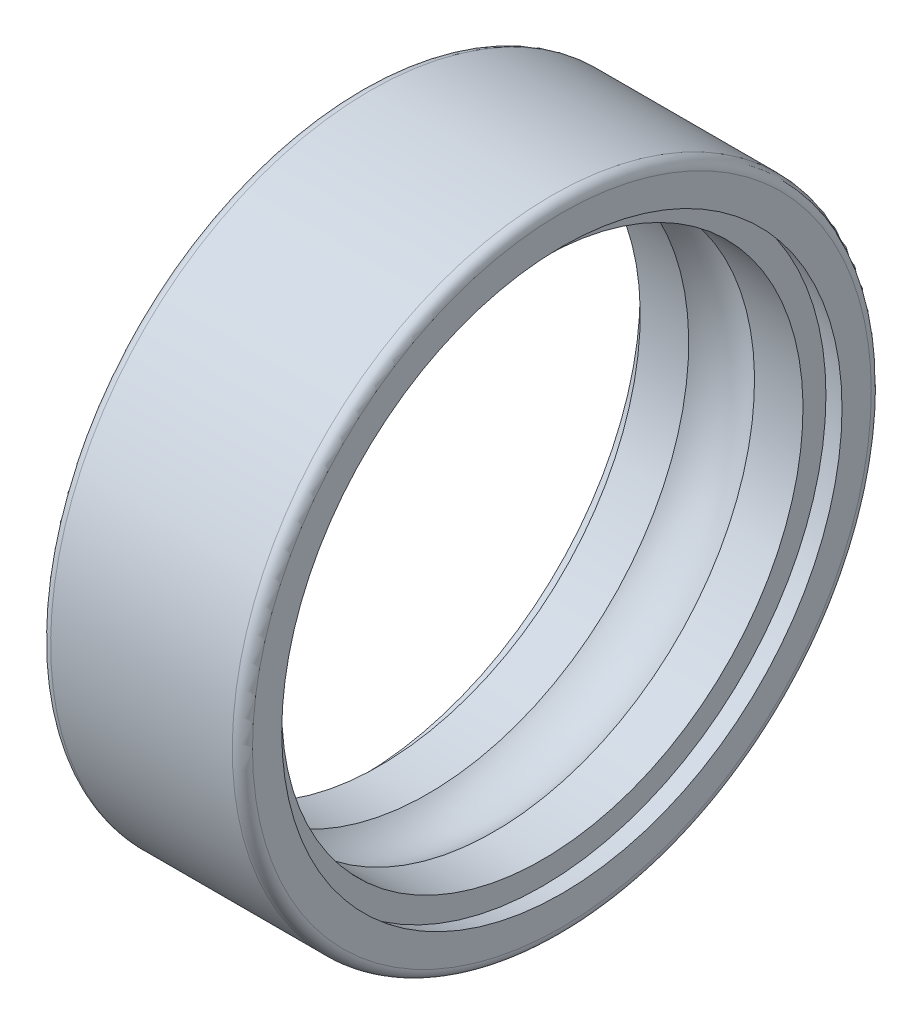
ISO-10303-21;
HEADER;
FILE_DESCRIPTION(('STEP AP214'),'2;1');
FILE_NAME('part.step','',(''),(''),'','','');
FILE_SCHEMA(('AUTOMOTIVE_DESIGN { 1 0 10303 214 1 1 1 1 }'));
ENDSEC;
DATA;
#1=APPLICATION_CONTEXT('core data for automotive mechanical design processes');
#2=APPLICATION_PROTOCOL_DEFINITION('international standard','automotive_design',2000,#1);
#3=PRODUCT_CONTEXT('',#1,'mechanical');
#4=PRODUCT('Part','Part','',(#3));
#5=PRODUCT_RELATED_PRODUCT_CATEGORY('part','',(#4));
#6=PRODUCT_DEFINITION_FORMATION('','',#4);
#7=PRODUCT_DEFINITION_CONTEXT('part definition',#1,'design');
#8=PRODUCT_DEFINITION('design','',#6,#7);
#9=PRODUCT_DEFINITION_SHAPE('','',#8);
#10=(LENGTH_UNIT() NAMED_UNIT(*) SI_UNIT(.MILLI.,.METRE.));
#11=(NAMED_UNIT(*) PLANE_ANGLE_UNIT() SI_UNIT($,.RADIAN.));
#12=(NAMED_UNIT(*) SI_UNIT($,.STERADIAN.) SOLID_ANGLE_UNIT());
#13=UNCERTAINTY_MEASURE_WITH_UNIT(LENGTH_MEASURE(1.E-05),#10,'distance_accuracy_value','');
#14=(GEOMETRIC_REPRESENTATION_CONTEXT(3) GLOBAL_UNCERTAINTY_ASSIGNED_CONTEXT((#13)) GLOBAL_UNIT_ASSIGNED_CONTEXT((#10,
#11,#12)) REPRESENTATION_CONTEXT('',''));
#15=CARTESIAN_POINT('',(0.,0.,0.));
#16=DIRECTION('',(0.,0.,1.));
#17=DIRECTION('',(1.,0.,0.));
#18=AXIS2_PLACEMENT_3D('',#15,#16,#17);
#19=CARTESIAN_POINT('',(4.69929956315124,0.,0.));
#20=DIRECTION('',(-1.,0.,0.));
#21=DIRECTION('',(0.,1.,0.));
#22=AXIS2_PLACEMENT_3D('',#19,#20,#21);
#23=CYLINDRICAL_SURFACE('',#22,7.75);
#24=CARTESIAN_POINT('',(5.42,0.,0.));
#25=DIRECTION('',(1.,0.,0.));
#26=DIRECTION('',(0.,1.,0.));
#27=AXIS2_PLACEMENT_3D('',#24,#25,#26);
#28=CIRCLE('',#27,7.75);
#29=CARTESIAN_POINT('',(5.42,7.75,0.));
#30=VERTEX_POINT('',#29);
#31=EDGE_CURVE('E11',#30,#30,#28,.T.);
#32=ORIENTED_EDGE('',*,*,#31,.T.);
#33=EDGE_LOOP('',(#32));
#34=FACE_BOUND('',#33,.T.);
#35=CARTESIAN_POINT('',(3.97859912630249,0.,0.));
#36=DIRECTION('',(1.,0.,0.));
#37=DIRECTION('',(0.,1.,0.));
#38=AXIS2_PLACEMENT_3D('',#35,#36,#37);
#39=CIRCLE('',#38,7.75);
#40=CARTESIAN_POINT('',(3.97859912630249,7.75,0.));
#41=VERTEX_POINT('',#40);
#42=EDGE_CURVE('E58',#41,#41,#39,.T.);
#43=ORIENTED_EDGE('',*,*,#42,.F.);
#44=EDGE_LOOP('',(#43));
#45=FACE_BOUND('',#44,.T.);
#46=ADVANCED_FACE('F16',(#34,#45),#23,.F.);
#47=CARTESIAN_POINT('',(5.42,8.09113482440546,0.));
#48=DIRECTION('',(1.,0.,0.));
#49=DIRECTION('',(0.,1.,0.));
#50=AXIS2_PLACEMENT_3D('',#47,#48,#49);
#51=PLANE('',#50);
#52=CARTESIAN_POINT('',(5.42,0.,0.));
#53=DIRECTION('',(1.,0.,0.));
#54=DIRECTION('',(0.,1.,0.));
#55=AXIS2_PLACEMENT_3D('',#52,#53,#54);
#56=CIRCLE('',#55,8.43226964881091);
#57=CARTESIAN_POINT('',(5.42,8.43226964881091,0.));
#58=VERTEX_POINT('',#57);
#59=EDGE_CURVE('E26',#58,#58,#56,.T.);
#60=ORIENTED_EDGE('',*,*,#59,.T.);
#61=EDGE_LOOP('',(#60));
#62=FACE_BOUND('',#61,.T.);
#63=ORIENTED_EDGE('',*,*,#31,.F.);
#64=EDGE_LOOP('',(#63));
#65=FACE_BOUND('',#64,.T.);
#66=ADVANCED_FACE('F18',(#62,#65),#51,.T.);
#67=CARTESIAN_POINT('',(5.71,0.,0.));
#68=DIRECTION('',(-1.,0.,0.));
#69=DIRECTION('',(0.,1.,0.));
#70=AXIS2_PLACEMENT_3D('',#67,#68,#69);
#71=CONICAL_SURFACE('',#70,8.38113482440546,0.174532925199433);
#72=CARTESIAN_POINT('',(6.,0.,0.));
#73=DIRECTION('',(1.,0.,0.));
#74=DIRECTION('',(0.,1.,0.));
#75=AXIS2_PLACEMENT_3D('',#72,#73,#74);
#76=CIRCLE('',#75,8.33);
#77=CARTESIAN_POINT('',(6.,8.33,0.));
#78=VERTEX_POINT('',#77);
#79=EDGE_CURVE('E68',#78,#78,#76,.T.);
#80=ORIENTED_EDGE('',*,*,#79,.T.);
#81=EDGE_LOOP('',(#80));
#82=FACE_BOUND('',#81,.T.);
#83=ORIENTED_EDGE('',*,*,#59,.F.);
#84=EDGE_LOOP('',(#83));
#85=FACE_BOUND('',#84,.T.);
#86=ADVANCED_FACE('F113',(#82,#85),#71,.F.);
#87=CARTESIAN_POINT('',(6.,8.765,0.));
#88=DIRECTION('',(1.,0.,0.));
#89=DIRECTION('',(0.,1.,0.));
#90=AXIS2_PLACEMENT_3D('',#87,#88,#89);
#91=PLANE('',#90);
#92=CARTESIAN_POINT('',(6.,0.,0.));
#93=DIRECTION('',(1.,0.,0.));
#94=DIRECTION('',(0.,1.,0.));
#95=AXIS2_PLACEMENT_3D('',#92,#93,#94);
#96=CIRCLE('',#95,9.2);
#97=CARTESIAN_POINT('',(6.,9.2,0.));
#98=VERTEX_POINT('',#97);
#99=EDGE_CURVE('E72',#98,#98,#96,.T.);
#100=ORIENTED_EDGE('',*,*,#99,.T.);
#101=EDGE_LOOP('',(#100));
#102=FACE_BOUND('',#101,.T.);
#103=ORIENTED_EDGE('',*,*,#79,.F.);
#104=EDGE_LOOP('',(#103));
#105=FACE_BOUND('',#104,.T.);
#106=ADVANCED_FACE('F124',(#102,#105),#91,.T.);
#107=CARTESIAN_POINT('',(5.7,0.,0.));
#108=DIRECTION('',(1.,0.,0.));
#109=DIRECTION('',(0.,0.,-1.));
#110=AXIS2_PLACEMENT_3D('',#107,#108,#109);
#111=TOROIDAL_SURFACE('',#110,9.2,0.3);
#112=CARTESIAN_POINT('',(5.7,0.,0.));
#113=DIRECTION('',(1.,0.,0.));
#114=DIRECTION('',(0.,1.,0.));
#115=AXIS2_PLACEMENT_3D('',#112,#113,#114);
#116=CIRCLE('',#115,9.5);
#117=CARTESIAN_POINT('',(5.7,9.5,0.));
#118=VERTEX_POINT('',#117);
#119=EDGE_CURVE('E70',#118,#118,#116,.T.);
#120=ORIENTED_EDGE('',*,*,#119,.T.);
#121=EDGE_LOOP('',(#120));
#122=FACE_BOUND('',#121,.T.);
#123=ORIENTED_EDGE('',*,*,#99,.F.);
#124=EDGE_LOOP('',(#123));
#125=FACE_BOUND('',#124,.T.);
#126=ADVANCED_FACE('F120',(#122,#125),#111,.T.);
#127=CARTESIAN_POINT('',(3.,0.,0.));
#128=DIRECTION('',(-1.,0.,0.));
#129=DIRECTION('',(0.,1.,0.));
#130=AXIS2_PLACEMENT_3D('',#127,#128,#129);
#131=CYLINDRICAL_SURFACE('',#130,9.5);
#132=CARTESIAN_POINT('',(0.3,0.,0.));
#133=DIRECTION('',(1.,0.,0.));
#134=DIRECTION('',(0.,1.,0.));
#135=AXIS2_PLACEMENT_3D('',#132,#133,#134);
#136=CIRCLE('',#135,9.5);
#137=CARTESIAN_POINT('',(0.3,9.5,0.));
#138=VERTEX_POINT('',#137);
#139=EDGE_CURVE('E73',#138,#138,#136,.T.);
#140=ORIENTED_EDGE('',*,*,#139,.T.);
#141=EDGE_LOOP('',(#140));
#142=FACE_BOUND('',#141,.T.);
#143=ORIENTED_EDGE('',*,*,#119,.F.);
#144=EDGE_LOOP('',(#143));
#145=FACE_BOUND('',#144,.T.);
#146=ADVANCED_FACE('F123',(#142,#145),#131,.T.);
#147=CARTESIAN_POINT('',(0.3,0.,0.));
#148=DIRECTION('',(1.,0.,0.));
#149=DIRECTION('',(0.,0.,-1.));
#150=AXIS2_PLACEMENT_3D('',#147,#148,#149);
#151=TOROIDAL_SURFACE('',#150,9.2,0.3);
#152=CARTESIAN_POINT('',(0.,0.,0.));
#153=DIRECTION('',(1.,0.,0.));
#154=DIRECTION('',(0.,1.,0.));
#155=AXIS2_PLACEMENT_3D('',#152,#153,#154);
#156=CIRCLE('',#155,9.2);
#157=CARTESIAN_POINT('',(0.,9.2,0.));
#158=VERTEX_POINT('',#157);
#159=EDGE_CURVE('E78',#158,#158,#156,.T.);
#160=ORIENTED_EDGE('',*,*,#159,.T.);
#161=EDGE_LOOP('',(#160));
#162=FACE_BOUND('',#161,.T.);
#163=ORIENTED_EDGE('',*,*,#139,.F.);
#164=EDGE_LOOP('',(#163));
#165=FACE_BOUND('',#164,.T.);
#166=ADVANCED_FACE('F104',(#162,#165),#151,.T.);
#167=CARTESIAN_POINT('',(0.,8.765,0.));
#168=DIRECTION('',(-1.,0.,0.));
#169=DIRECTION('',(0.,-1.,0.));
#170=AXIS2_PLACEMENT_3D('',#167,#168,#169);
#171=PLANE('',#170);
#172=CARTESIAN_POINT('',(0.,0.,0.));
#173=DIRECTION('',(1.,0.,0.));
#174=DIRECTION('',(0.,1.,0.));
#175=AXIS2_PLACEMENT_3D('',#172,#173,#174);
#176=CIRCLE('',#175,8.33);
#177=CARTESIAN_POINT('',(0.,8.33,0.));
#178=VERTEX_POINT('',#177);
#179=EDGE_CURVE('E83',#178,#178,#176,.T.);
#180=ORIENTED_EDGE('',*,*,#179,.T.);
#181=EDGE_LOOP('',(#180));
#182=FACE_BOUND('',#181,.T.);
#183=ORIENTED_EDGE('',*,*,#159,.F.);
#184=EDGE_LOOP('',(#183));
#185=FACE_BOUND('',#184,.T.);
#186=ADVANCED_FACE('F89',(#182,#185),#171,.T.);
#187=CARTESIAN_POINT('',(0.29,0.,0.));
#188=DIRECTION('',(1.,0.,0.));
#189=DIRECTION('',(0.,1.,0.));
#190=AXIS2_PLACEMENT_3D('',#187,#188,#189);
#191=CONICAL_SURFACE('',#190,8.38113482440546,0.174532925199434);
#192=CARTESIAN_POINT('',(0.58,0.,0.));
#193=DIRECTION('',(1.,0.,0.));
#194=DIRECTION('',(0.,1.,0.));
#195=AXIS2_PLACEMENT_3D('',#192,#193,#194);
#196=CIRCLE('',#195,8.43226964881091);
#197=CARTESIAN_POINT('',(0.58,8.43226964881091,0.));
#198=VERTEX_POINT('',#197);
#199=EDGE_CURVE('E64',#198,#198,#196,.T.);
#200=ORIENTED_EDGE('',*,*,#199,.T.);
#201=EDGE_LOOP('',(#200));
#202=FACE_BOUND('',#201,.T.);
#203=ORIENTED_EDGE('',*,*,#179,.F.);
#204=EDGE_LOOP('',(#203));
#205=FACE_BOUND('',#204,.T.);
#206=ADVANCED_FACE('F92',(#202,#205),#191,.F.);
#207=CARTESIAN_POINT('',(0.58,8.09113482440546,0.));
#208=DIRECTION('',(-1.,0.,0.));
#209=DIRECTION('',(0.,-1.,0.));
#210=AXIS2_PLACEMENT_3D('',#207,#208,#209);
#211=PLANE('',#210);
#212=CARTESIAN_POINT('',(0.58,0.,0.));
#213=DIRECTION('',(1.,0.,0.));
#214=DIRECTION('',(0.,1.,0.));
#215=AXIS2_PLACEMENT_3D('',#212,#213,#214);
#216=CIRCLE('',#215,7.75);
#217=CARTESIAN_POINT('',(0.58,7.75,0.));
#218=VERTEX_POINT('',#217);
#219=EDGE_CURVE('E59',#218,#218,#216,.T.);
#220=ORIENTED_EDGE('',*,*,#219,.T.);
#221=EDGE_LOOP('',(#220));
#222=FACE_BOUND('',#221,.T.);
#223=ORIENTED_EDGE('',*,*,#199,.F.);
#224=EDGE_LOOP('',(#223));
#225=FACE_BOUND('',#224,.T.);
#226=ADVANCED_FACE('F94',(#222,#225),#211,.T.);
#227=CARTESIAN_POINT('',(1.30070043684875,0.,0.));
#228=DIRECTION('',(-1.,0.,0.));
#229=DIRECTION('',(0.,1.,0.));
#230=AXIS2_PLACEMENT_3D('',#227,#228,#229);
#231=CYLINDRICAL_SURFACE('',#230,7.75);
#232=CARTESIAN_POINT('',(2.02140087369751,0.,0.));
#233=DIRECTION('',(1.,0.,0.));
#234=DIRECTION('',(0.,1.,0.));
#235=AXIS2_PLACEMENT_3D('',#232,#233,#234);
#236=CIRCLE('',#235,7.75);
#237=CARTESIAN_POINT('',(2.02140087369751,7.75,0.));
#238=VERTEX_POINT('',#237);
#239=EDGE_CURVE('E20',#238,#238,#236,.T.);
#240=ORIENTED_EDGE('',*,*,#239,.T.);
#241=EDGE_LOOP('',(#240));
#242=FACE_BOUND('',#241,.T.);
#243=ORIENTED_EDGE('',*,*,#219,.F.);
#244=EDGE_LOOP('',(#243));
#245=FACE_BOUND('',#244,.T.);
#246=ADVANCED_FACE('F55',(#242,#245),#231,.F.);
#247=CARTESIAN_POINT('',(3.,0.,0.));
#248=DIRECTION('',(1.,0.,0.));
#249=DIRECTION('',(0.,0.,-1.));
#250=AXIS2_PLACEMENT_3D('',#247,#248,#249);
#251=TOROIDAL_SURFACE('',#250,6.5,1.5875);
#252=ORIENTED_EDGE('',*,*,#42,.T.);
#253=EDGE_LOOP('',(#252));
#254=FACE_BOUND('',#253,.T.);
#255=ORIENTED_EDGE('',*,*,#239,.F.);
#256=EDGE_LOOP('',(#255));
#257=FACE_BOUND('',#256,.T.);
#258=ADVANCED_FACE('F117',(#254,#257),#251,.F.);
#259=CLOSED_SHELL('',(#46,#66,#86,#106,#126,#146,#166,#186,#206,#226,#246,#258));
#260=MANIFOLD_SOLID_BREP('B1',#259);
#261=ADVANCED_BREP_SHAPE_REPRESENTATION('',(#18,#260),#14);
#262=SHAPE_DEFINITION_REPRESENTATION(#9,#261);
ENDSEC;
END-ISO-10303-21;
